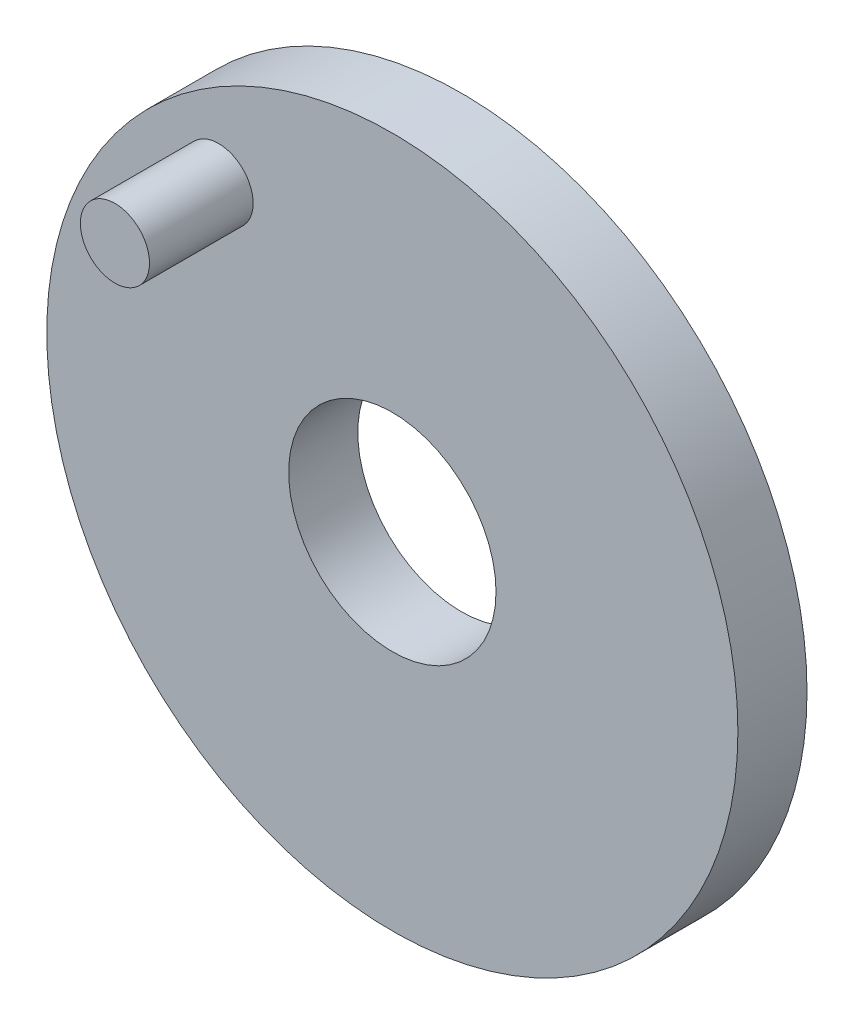
ISO-10303-21;
HEADER;
FILE_DESCRIPTION(('STEP AP214'),'2;1');
FILE_NAME('part.step','',(''),(''),'','','');
FILE_SCHEMA(('AUTOMOTIVE_DESIGN { 1 0 10303 214 1 1 1 1 }'));
ENDSEC;
DATA;
#1=APPLICATION_CONTEXT('core data for automotive mechanical design processes');
#2=APPLICATION_PROTOCOL_DEFINITION('international standard','automotive_design',2000,#1);
#3=PRODUCT_CONTEXT('',#1,'mechanical');
#4=PRODUCT('Part','Part','',(#3));
#5=PRODUCT_RELATED_PRODUCT_CATEGORY('part','',(#4));
#6=PRODUCT_DEFINITION_FORMATION('','',#4);
#7=PRODUCT_DEFINITION_CONTEXT('part definition',#1,'design');
#8=PRODUCT_DEFINITION('design','',#6,#7);
#9=PRODUCT_DEFINITION_SHAPE('','',#8);
#10=(LENGTH_UNIT() NAMED_UNIT(*) SI_UNIT(.MILLI.,.METRE.));
#11=(NAMED_UNIT(*) PLANE_ANGLE_UNIT() SI_UNIT($,.RADIAN.));
#12=(NAMED_UNIT(*) SI_UNIT($,.STERADIAN.) SOLID_ANGLE_UNIT());
#13=UNCERTAINTY_MEASURE_WITH_UNIT(LENGTH_MEASURE(1.E-05),#10,'distance_accuracy_value','');
#14=(GEOMETRIC_REPRESENTATION_CONTEXT(3) GLOBAL_UNCERTAINTY_ASSIGNED_CONTEXT((#13)) GLOBAL_UNIT_ASSIGNED_CONTEXT((#10,
#11,#12)) REPRESENTATION_CONTEXT('',''));
#15=CARTESIAN_POINT('',(0.,0.,0.));
#16=DIRECTION('',(0.,0.,1.));
#17=DIRECTION('',(1.,0.,0.));
#18=AXIS2_PLACEMENT_3D('',#15,#16,#17);
#19=CARTESIAN_POINT('',(0.,0.,-10.));
#20=DIRECTION('',(0.,0.,1.));
#21=DIRECTION('',(1.,0.,0.));
#22=AXIS2_PLACEMENT_3D('',#19,#20,#21);
#23=CYLINDRICAL_SURFACE('',#22,50.);
#24=CARTESIAN_POINT('',(0.,0.,-10.));
#25=DIRECTION('',(0.,0.,1.));
#26=DIRECTION('',(1.,0.,0.));
#27=AXIS2_PLACEMENT_3D('',#24,#25,#26);
#28=CIRCLE('',#27,50.);
#29=CARTESIAN_POINT('',(50.,0.,-10.));
#30=VERTEX_POINT('',#29);
#31=EDGE_CURVE('E10',#30,#30,#28,.T.);
#32=ORIENTED_EDGE('',*,*,#31,.T.);
#33=EDGE_LOOP('',(#32));
#34=FACE_BOUND('',#33,.T.);
#35=CARTESIAN_POINT('',(0.,0.,0.));
#36=DIRECTION('',(0.,0.,1.));
#37=DIRECTION('',(1.,0.,0.));
#38=AXIS2_PLACEMENT_3D('',#35,#36,#37);
#39=CIRCLE('',#38,50.);
#40=CARTESIAN_POINT('',(50.,0.,0.));
#41=VERTEX_POINT('',#40);
#42=EDGE_CURVE('E18',#41,#41,#39,.T.);
#43=ORIENTED_EDGE('',*,*,#42,.F.);
#44=EDGE_LOOP('',(#43));
#45=FACE_BOUND('',#44,.T.);
#46=ADVANCED_FACE('F15',(#34,#45),#23,.T.);
#47=CARTESIAN_POINT('',(0.,0.,-10.));
#48=DIRECTION('',(0.,0.,1.));
#49=DIRECTION('',(1.,0.,0.));
#50=AXIS2_PLACEMENT_3D('',#47,#48,#49);
#51=PLANE('',#50);
#52=CARTESIAN_POINT('',(0.,0.,-10.));
#53=DIRECTION('',(0.,0.,1.));
#54=DIRECTION('',(1.,0.,0.));
#55=AXIS2_PLACEMENT_3D('',#52,#53,#54);
#56=CIRCLE('',#55,15.);
#57=CARTESIAN_POINT('',(15.,0.,-10.));
#58=VERTEX_POINT('',#57);
#59=EDGE_CURVE('E25',#58,#58,#56,.T.);
#60=ORIENTED_EDGE('',*,*,#59,.T.);
#61=EDGE_LOOP('',(#60));
#62=FACE_BOUND('',#61,.T.);
#63=ORIENTED_EDGE('',*,*,#31,.F.);
#64=EDGE_LOOP('',(#63));
#65=FACE_BOUND('',#64,.T.);
#66=ADVANCED_FACE('F51',(#62,#65),#51,.F.);
#67=CARTESIAN_POINT('',(0.,0.,0.));
#68=DIRECTION('',(0.,0.,1.));
#69=DIRECTION('',(1.,0.,0.));
#70=AXIS2_PLACEMENT_3D('',#67,#68,#69);
#71=PLANE('',#70);
#72=CARTESIAN_POINT('',(-25.1386348440903,31.1134864355554,0.));
#73=DIRECTION('',(0.,0.,1.));
#74=DIRECTION('',(1.,0.,0.));
#75=AXIS2_PLACEMENT_3D('',#72,#73,#74);
#76=CIRCLE('',#75,5.);
#77=CARTESIAN_POINT('',(-20.1386348440903,31.1134864355554,0.));
#78=VERTEX_POINT('',#77);
#79=EDGE_CURVE('E33',#78,#78,#76,.T.);
#80=ORIENTED_EDGE('',*,*,#79,.F.);
#81=EDGE_LOOP('',(#80));
#82=FACE_BOUND('',#81,.T.);
#83=CARTESIAN_POINT('',(0.,0.,0.));
#84=DIRECTION('',(0.,0.,1.));
#85=DIRECTION('',(1.,0.,0.));
#86=AXIS2_PLACEMENT_3D('',#83,#84,#85);
#87=CIRCLE('',#86,15.);
#88=CARTESIAN_POINT('',(15.,0.,0.));
#89=VERTEX_POINT('',#88);
#90=EDGE_CURVE('E27',#89,#89,#87,.T.);
#91=ORIENTED_EDGE('',*,*,#90,.F.);
#92=EDGE_LOOP('',(#91));
#93=FACE_BOUND('',#92,.T.);
#94=ORIENTED_EDGE('',*,*,#42,.T.);
#95=EDGE_LOOP('',(#94));
#96=FACE_BOUND('',#95,.T.);
#97=ADVANCED_FACE('F48',(#82,#93,#96),#71,.T.);
#98=CARTESIAN_POINT('',(0.,0.,-10.));
#99=DIRECTION('',(0.,0.,1.));
#100=DIRECTION('',(1.,0.,0.));
#101=AXIS2_PLACEMENT_3D('',#98,#99,#100);
#102=CYLINDRICAL_SURFACE('',#101,15.);
#103=ORIENTED_EDGE('',*,*,#59,.F.);
#104=EDGE_LOOP('',(#103));
#105=FACE_BOUND('',#104,.T.);
#106=ORIENTED_EDGE('',*,*,#90,.T.);
#107=EDGE_LOOP('',(#106));
#108=FACE_BOUND('',#107,.T.);
#109=ADVANCED_FACE('F44',(#105,#108),#102,.F.);
#110=CARTESIAN_POINT('',(-25.1386348440903,31.1134864355554,15.));
#111=DIRECTION('',(0.,0.,-1.));
#112=DIRECTION('',(-1.,0.,0.));
#113=AXIS2_PLACEMENT_3D('',#110,#111,#112);
#114=CYLINDRICAL_SURFACE('',#113,5.);
#115=CARTESIAN_POINT('',(-25.1386348440903,31.1134864355554,15.));
#116=DIRECTION('',(0.,0.,1.));
#117=DIRECTION('',(1.,0.,0.));
#118=AXIS2_PLACEMENT_3D('',#115,#116,#117);
#119=CIRCLE('',#118,5.);
#120=CARTESIAN_POINT('',(-20.1386348440903,31.1134864355554,15.));
#121=VERTEX_POINT('',#120);
#122=EDGE_CURVE('E30',#121,#121,#119,.T.);
#123=ORIENTED_EDGE('',*,*,#122,.F.);
#124=EDGE_LOOP('',(#123));
#125=FACE_BOUND('',#124,.T.);
#126=ORIENTED_EDGE('',*,*,#79,.T.);
#127=EDGE_LOOP('',(#126));
#128=FACE_BOUND('',#127,.T.);
#129=ADVANCED_FACE('F41',(#125,#128),#114,.T.);
#130=CARTESIAN_POINT('',(-25.1386348440903,31.1134864355554,15.));
#131=DIRECTION('',(0.,0.,1.));
#132=DIRECTION('',(1.,0.,0.));
#133=AXIS2_PLACEMENT_3D('',#130,#131,#132);
#134=PLANE('',#133);
#135=ORIENTED_EDGE('',*,*,#122,.T.);
#136=EDGE_LOOP('',(#135));
#137=FACE_BOUND('',#136,.T.);
#138=ADVANCED_FACE('F39',(#137),#134,.T.);
#139=CLOSED_SHELL('',(#46,#66,#97,#109,#129,#138));
#140=MANIFOLD_SOLID_BREP('B1',#139);
#141=ADVANCED_BREP_SHAPE_REPRESENTATION('',(#18,#140),#14);
#142=SHAPE_DEFINITION_REPRESENTATION(#9,#141);
ENDSEC;
END-ISO-10303-21;
